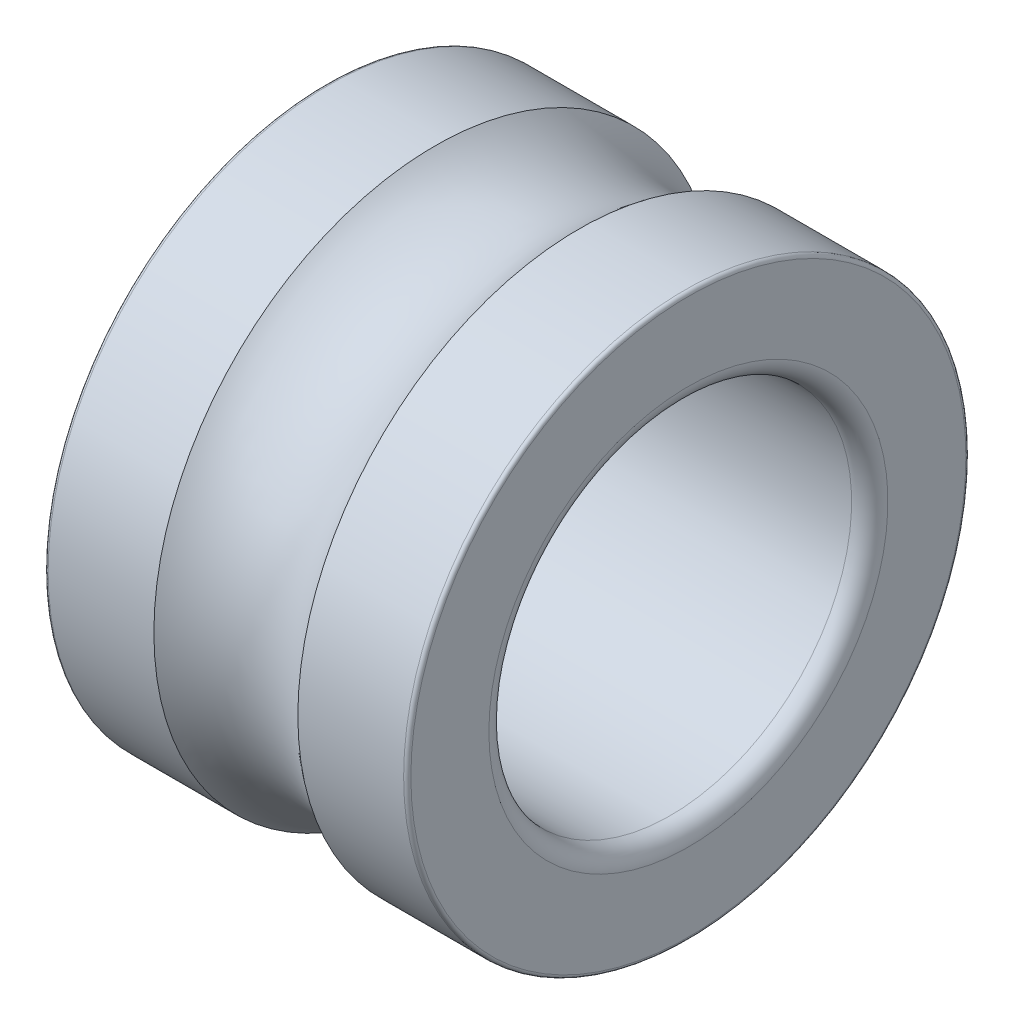
ISO-10303-21;
HEADER;
FILE_DESCRIPTION(('STEP AP214'),'2;1');
FILE_NAME('part.step','',(''),(''),'','','');
FILE_SCHEMA(('AUTOMOTIVE_DESIGN { 1 0 10303 214 1 1 1 1 }'));
ENDSEC;
DATA;
#1=APPLICATION_CONTEXT('core data for automotive mechanical design processes');
#2=APPLICATION_PROTOCOL_DEFINITION('international standard','automotive_design',2000,#1);
#3=PRODUCT_CONTEXT('',#1,'mechanical');
#4=PRODUCT('Part','Part','',(#3));
#5=PRODUCT_RELATED_PRODUCT_CATEGORY('part','',(#4));
#6=PRODUCT_DEFINITION_FORMATION('','',#4);
#7=PRODUCT_DEFINITION_CONTEXT('part definition',#1,'design');
#8=PRODUCT_DEFINITION('design','',#6,#7);
#9=PRODUCT_DEFINITION_SHAPE('','',#8);
#10=(LENGTH_UNIT() NAMED_UNIT(*) SI_UNIT(.MILLI.,.METRE.));
#11=(NAMED_UNIT(*) PLANE_ANGLE_UNIT() SI_UNIT($,.RADIAN.));
#12=(NAMED_UNIT(*) SI_UNIT($,.STERADIAN.) SOLID_ANGLE_UNIT());
#13=UNCERTAINTY_MEASURE_WITH_UNIT(LENGTH_MEASURE(1.E-05),#10,'distance_accuracy_value','');
#14=(GEOMETRIC_REPRESENTATION_CONTEXT(3) GLOBAL_UNCERTAINTY_ASSIGNED_CONTEXT((#13)) GLOBAL_UNIT_ASSIGNED_CONTEXT((#10,
#11,#12)) REPRESENTATION_CONTEXT('',''));
#15=CARTESIAN_POINT('',(0.,0.,0.));
#16=DIRECTION('',(0.,0.,1.));
#17=DIRECTION('',(1.,0.,0.));
#18=AXIS2_PLACEMENT_3D('',#15,#16,#17);
#19=CARTESIAN_POINT('',(0.00999999999999221,0.,0.));
#20=DIRECTION('',(-1.,0.,0.));
#21=DIRECTION('',(0.,0.,1.));
#22=AXIS2_PLACEMENT_3D('',#19,#20,#21);
#23=TOROIDAL_SURFACE('',#22,0.765000000000008,0.00999999999999222);
#24=CARTESIAN_POINT('',(0.,0.,0.));
#25=DIRECTION('',(-1.,0.,0.));
#26=DIRECTION('',(0.,0.,1.));
#27=AXIS2_PLACEMENT_3D('',#24,#25,#26);
#28=CIRCLE('',#27,0.765);
#29=CARTESIAN_POINT('',(0.,0.,0.765));
#30=VERTEX_POINT('',#29);
#31=EDGE_CURVE('E10',#30,#30,#28,.T.);
#32=ORIENTED_EDGE('',*,*,#31,.F.);
#33=EDGE_LOOP('',(#32));
#34=FACE_BOUND('',#33,.T.);
#35=CARTESIAN_POINT('',(0.0100000000000031,0.,0.));
#36=DIRECTION('',(-1.,0.,0.));
#37=DIRECTION('',(0.,0.,1.));
#38=AXIS2_PLACEMENT_3D('',#35,#36,#37);
#39=CIRCLE('',#38,0.775);
#40=CARTESIAN_POINT('',(0.0100000000000031,0.,0.775));
#41=VERTEX_POINT('',#40);
#42=EDGE_CURVE('E65',#41,#41,#39,.T.);
#43=ORIENTED_EDGE('',*,*,#42,.T.);
#44=EDGE_LOOP('',(#43));
#45=FACE_BOUND('',#44,.T.);
#46=ADVANCED_FACE('F31',(#34,#45),#23,.T.);
#47=CARTESIAN_POINT('',(0.,0.765,0.));
#48=DIRECTION('',(1.,0.,0.));
#49=DIRECTION('',(0.,0.,-1.));
#50=AXIS2_PLACEMENT_3D('',#47,#48,#49);
#51=PLANE('',#50);
#52=CARTESIAN_POINT('',(0.,0.,0.));
#53=DIRECTION('',(-1.,0.,0.));
#54=DIRECTION('',(0.,0.,1.));
#55=AXIS2_PLACEMENT_3D('',#52,#53,#54);
#56=CIRCLE('',#55,0.55);
#57=CARTESIAN_POINT('',(0.,0.,0.55));
#58=VERTEX_POINT('',#57);
#59=EDGE_CURVE('E37',#58,#58,#56,.T.);
#60=ORIENTED_EDGE('',*,*,#59,.F.);
#61=EDGE_LOOP('',(#60));
#62=FACE_BOUND('',#61,.T.);
#63=ORIENTED_EDGE('',*,*,#31,.T.);
#64=EDGE_LOOP('',(#63));
#65=FACE_BOUND('',#64,.T.);
#66=ADVANCED_FACE('F114',(#62,#65),#51,.F.);
#67=CARTESIAN_POINT('',(0.0499999999999962,0.,0.));
#68=DIRECTION('',(-1.,0.,0.));
#69=DIRECTION('',(0.,0.,1.));
#70=AXIS2_PLACEMENT_3D('',#67,#68,#69);
#71=TOROIDAL_SURFACE('',#70,0.549999999999996,0.0499999999999961);
#72=CARTESIAN_POINT('',(0.0500000000000014,0.,0.));
#73=DIRECTION('',(-1.,0.,0.));
#74=DIRECTION('',(0.,0.,1.));
#75=AXIS2_PLACEMENT_3D('',#72,#73,#74);
#76=CIRCLE('',#75,0.5);
#77=CARTESIAN_POINT('',(0.0500000000000014,0.,0.5));
#78=VERTEX_POINT('',#77);
#79=EDGE_CURVE('E41',#78,#78,#76,.T.);
#80=ORIENTED_EDGE('',*,*,#79,.F.);
#81=EDGE_LOOP('',(#80));
#82=FACE_BOUND('',#81,.T.);
#83=ORIENTED_EDGE('',*,*,#59,.T.);
#84=EDGE_LOOP('',(#83));
#85=FACE_BOUND('',#84,.T.);
#86=ADVANCED_FACE('F109',(#82,#85),#71,.T.);
#87=CARTESIAN_POINT('',(50.,0.,0.));
#88=DIRECTION('',(-1.,0.,0.));
#89=DIRECTION('',(0.,0.,1.));
#90=AXIS2_PLACEMENT_3D('',#87,#88,#89);
#91=CYLINDRICAL_SURFACE('',#90,0.5);
#92=CARTESIAN_POINT('',(0.95,0.,0.));
#93=DIRECTION('',(-1.,0.,0.));
#94=DIRECTION('',(0.,0.,1.));
#95=AXIS2_PLACEMENT_3D('',#92,#93,#94);
#96=CIRCLE('',#95,0.5);
#97=CARTESIAN_POINT('',(0.95,0.,0.5));
#98=VERTEX_POINT('',#97);
#99=EDGE_CURVE('E45',#98,#98,#96,.T.);
#100=ORIENTED_EDGE('',*,*,#99,.F.);
#101=EDGE_LOOP('',(#100));
#102=FACE_BOUND('',#101,.T.);
#103=ORIENTED_EDGE('',*,*,#79,.T.);
#104=EDGE_LOOP('',(#103));
#105=FACE_BOUND('',#104,.T.);
#106=ADVANCED_FACE('F103',(#102,#105),#91,.F.);
#107=CARTESIAN_POINT('',(0.950000000000009,0.,0.));
#108=DIRECTION('',(-1.,0.,0.));
#109=DIRECTION('',(0.,0.,1.));
#110=AXIS2_PLACEMENT_3D('',#107,#108,#109);
#111=TOROIDAL_SURFACE('',#110,0.549999999999991,0.0499999999999912);
#112=CARTESIAN_POINT('',(1.,0.,0.));
#113=DIRECTION('',(-1.,0.,0.));
#114=DIRECTION('',(0.,0.,1.));
#115=AXIS2_PLACEMENT_3D('',#112,#113,#114);
#116=CIRCLE('',#115,0.549999999999991);
#117=CARTESIAN_POINT('',(1.,0.,0.549999999999991));
#118=VERTEX_POINT('',#117);
#119=EDGE_CURVE('E50',#118,#118,#116,.T.);
#120=ORIENTED_EDGE('',*,*,#119,.F.);
#121=EDGE_LOOP('',(#120));
#122=FACE_BOUND('',#121,.T.);
#123=ORIENTED_EDGE('',*,*,#99,.T.);
#124=EDGE_LOOP('',(#123));
#125=FACE_BOUND('',#124,.T.);
#126=ADVANCED_FACE('F97',(#122,#125),#111,.T.);
#127=CARTESIAN_POINT('',(1.,0.55,0.));
#128=DIRECTION('',(-1.,0.,0.));
#129=DIRECTION('',(0.,0.,1.));
#130=AXIS2_PLACEMENT_3D('',#127,#128,#129);
#131=PLANE('',#130);
#132=CARTESIAN_POINT('',(1.,0.,0.));
#133=DIRECTION('',(-1.,0.,0.));
#134=DIRECTION('',(0.,0.,1.));
#135=AXIS2_PLACEMENT_3D('',#132,#133,#134);
#136=CIRCLE('',#135,0.765);
#137=CARTESIAN_POINT('',(1.,0.,0.765));
#138=VERTEX_POINT('',#137);
#139=EDGE_CURVE('E53',#138,#138,#136,.T.);
#140=ORIENTED_EDGE('',*,*,#139,.F.);
#141=EDGE_LOOP('',(#140));
#142=FACE_BOUND('',#141,.T.);
#143=ORIENTED_EDGE('',*,*,#119,.T.);
#144=EDGE_LOOP('',(#143));
#145=FACE_BOUND('',#144,.T.);
#146=ADVANCED_FACE('F91',(#142,#145),#131,.F.);
#147=CARTESIAN_POINT('',(0.990000000000015,0.,0.));
#148=DIRECTION('',(-1.,0.,0.));
#149=DIRECTION('',(0.,0.,1.));
#150=AXIS2_PLACEMENT_3D('',#147,#148,#149);
#151=TOROIDAL_SURFACE('',#150,0.765000000000015,0.00999999999998463);
#152=CARTESIAN_POINT('',(0.989999999999998,0.,0.));
#153=DIRECTION('',(-1.,0.,0.));
#154=DIRECTION('',(0.,0.,1.));
#155=AXIS2_PLACEMENT_3D('',#152,#153,#154);
#156=CIRCLE('',#155,0.775);
#157=CARTESIAN_POINT('',(0.989999999999998,0.,0.775));
#158=VERTEX_POINT('',#157);
#159=EDGE_CURVE('E56',#158,#158,#156,.T.);
#160=ORIENTED_EDGE('',*,*,#159,.F.);
#161=EDGE_LOOP('',(#160));
#162=FACE_BOUND('',#161,.T.);
#163=ORIENTED_EDGE('',*,*,#139,.T.);
#164=EDGE_LOOP('',(#163));
#165=FACE_BOUND('',#164,.T.);
#166=ADVANCED_FACE('F85',(#162,#165),#151,.T.);
#167=CARTESIAN_POINT('',(50.,0.,0.));
#168=DIRECTION('',(-1.,0.,0.));
#169=DIRECTION('',(0.,0.,1.));
#170=AXIS2_PLACEMENT_3D('',#167,#168,#169);
#171=CYLINDRICAL_SURFACE('',#170,0.775);
#172=CARTESIAN_POINT('',(0.698431348329837,0.,0.));
#173=DIRECTION('',(-1.,0.,0.));
#174=DIRECTION('',(0.,0.,1.));
#175=AXIS2_PLACEMENT_3D('',#172,#173,#174);
#176=CIRCLE('',#175,0.775);
#177=CARTESIAN_POINT('',(0.698431348329837,0.,0.775));
#178=VERTEX_POINT('',#177);
#179=EDGE_CURVE('E59',#178,#178,#176,.T.);
#180=ORIENTED_EDGE('',*,*,#179,.F.);
#181=EDGE_LOOP('',(#180));
#182=FACE_BOUND('',#181,.T.);
#183=ORIENTED_EDGE('',*,*,#159,.T.);
#184=EDGE_LOOP('',(#183));
#185=FACE_BOUND('',#184,.T.);
#186=ADVANCED_FACE('F79',(#182,#185),#171,.T.);
#187=CARTESIAN_POINT('',(0.5,0.,0.));
#188=DIRECTION('',(-1.,0.,0.));
#189=DIRECTION('',(0.,0.,1.));
#190=AXIS2_PLACEMENT_3D('',#187,#188,#189);
#191=TOROIDAL_SURFACE('',#190,0.999999999999989,0.299999999999989);
#192=CARTESIAN_POINT('',(0.301568651670157,0.,0.));
#193=DIRECTION('',(-1.,0.,0.));
#194=DIRECTION('',(0.,0.,1.));
#195=AXIS2_PLACEMENT_3D('',#192,#193,#194);
#196=CIRCLE('',#195,0.775);
#197=CARTESIAN_POINT('',(0.301568651670157,0.,0.775));
#198=VERTEX_POINT('',#197);
#199=EDGE_CURVE('E62',#198,#198,#196,.T.);
#200=ORIENTED_EDGE('',*,*,#199,.F.);
#201=EDGE_LOOP('',(#200));
#202=FACE_BOUND('',#201,.T.);
#203=ORIENTED_EDGE('',*,*,#179,.T.);
#204=EDGE_LOOP('',(#203));
#205=FACE_BOUND('',#204,.T.);
#206=ADVANCED_FACE('F73',(#202,#205),#191,.F.);
#207=CARTESIAN_POINT('',(50.,0.,0.));
#208=DIRECTION('',(-1.,0.,0.));
#209=DIRECTION('',(0.,0.,1.));
#210=AXIS2_PLACEMENT_3D('',#207,#208,#209);
#211=CYLINDRICAL_SURFACE('',#210,0.775);
#212=ORIENTED_EDGE('',*,*,#42,.F.);
#213=EDGE_LOOP('',(#212));
#214=FACE_BOUND('',#213,.T.);
#215=ORIENTED_EDGE('',*,*,#199,.T.);
#216=EDGE_LOOP('',(#215));
#217=FACE_BOUND('',#216,.T.);
#218=ADVANCED_FACE('F70',(#214,#217),#211,.T.);
#219=CLOSED_SHELL('',(#46,#66,#86,#106,#126,#146,#166,#186,#206,#218));
#220=MANIFOLD_SOLID_BREP('B2',#219);
#221=ADVANCED_BREP_SHAPE_REPRESENTATION('',(#18,#220),#14);
#222=SHAPE_DEFINITION_REPRESENTATION(#9,#221);
ENDSEC;
END-ISO-10303-21;
